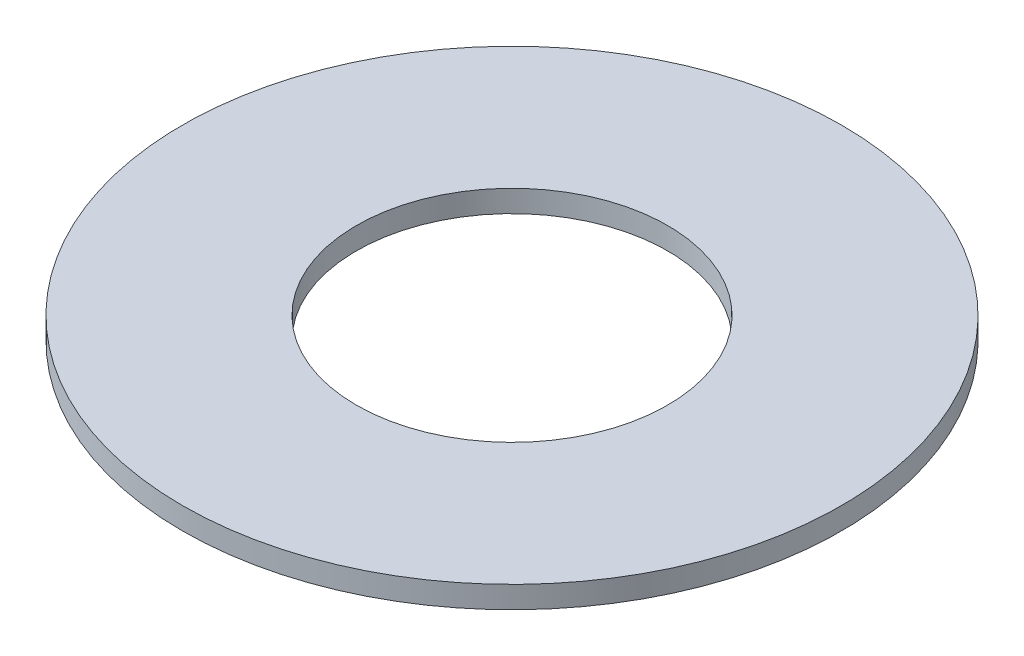
ISO-10303-21;
HEADER;
FILE_DESCRIPTION(('STEP AP214'),'2;1');
FILE_NAME('part.step','',(''),(''),'','','');
FILE_SCHEMA(('AUTOMOTIVE_DESIGN { 1 0 10303 214 1 1 1 1 }'));
ENDSEC;
DATA;
#1=APPLICATION_CONTEXT('core data for automotive mechanical design processes');
#2=APPLICATION_PROTOCOL_DEFINITION('international standard','automotive_design',2000,#1);
#3=PRODUCT_CONTEXT('',#1,'mechanical');
#4=PRODUCT('Part','Part','',(#3));
#5=PRODUCT_RELATED_PRODUCT_CATEGORY('part','',(#4));
#6=PRODUCT_DEFINITION_FORMATION('','',#4);
#7=PRODUCT_DEFINITION_CONTEXT('part definition',#1,'design');
#8=PRODUCT_DEFINITION('design','',#6,#7);
#9=PRODUCT_DEFINITION_SHAPE('','',#8);
#10=(LENGTH_UNIT() NAMED_UNIT(*) SI_UNIT(.MILLI.,.METRE.));
#11=(NAMED_UNIT(*) PLANE_ANGLE_UNIT() SI_UNIT($,.RADIAN.));
#12=(NAMED_UNIT(*) SI_UNIT($,.STERADIAN.) SOLID_ANGLE_UNIT());
#13=UNCERTAINTY_MEASURE_WITH_UNIT(LENGTH_MEASURE(1.E-05),#10,'distance_accuracy_value','');
#14=(GEOMETRIC_REPRESENTATION_CONTEXT(3) GLOBAL_UNCERTAINTY_ASSIGNED_CONTEXT((#13)) GLOBAL_UNIT_ASSIGNED_CONTEXT((#10,
#11,#12)) REPRESENTATION_CONTEXT('',''));
#15=CARTESIAN_POINT('',(0.,0.,0.));
#16=DIRECTION('',(0.,0.,1.));
#17=DIRECTION('',(1.,0.,0.));
#18=AXIS2_PLACEMENT_3D('',#15,#16,#17);
#19=CARTESIAN_POINT('',(0.,6.,0.));
#20=DIRECTION('',(0.,-1.,0.));
#21=DIRECTION('',(0.,0.,-1.));
#22=AXIS2_PLACEMENT_3D('',#19,#20,#21);
#23=CYLINDRICAL_SURFACE('',#22,90.);
#24=CARTESIAN_POINT('',(0.,6.,0.));
#25=DIRECTION('',(0.,1.,0.));
#26=DIRECTION('',(0.,0.,1.));
#27=AXIS2_PLACEMENT_3D('',#24,#25,#26);
#28=CIRCLE('',#27,90.);
#29=CARTESIAN_POINT('',(0.,6.,90.));
#30=VERTEX_POINT('',#29);
#31=EDGE_CURVE('E10',#30,#30,#28,.T.);
#32=ORIENTED_EDGE('',*,*,#31,.F.);
#33=EDGE_LOOP('',(#32));
#34=FACE_BOUND('',#33,.T.);
#35=CARTESIAN_POINT('',(0.,0.,0.));
#36=DIRECTION('',(0.,1.,0.));
#37=DIRECTION('',(0.,0.,1.));
#38=AXIS2_PLACEMENT_3D('',#35,#36,#37);
#39=CIRCLE('',#38,90.);
#40=CARTESIAN_POINT('',(0.,0.,90.));
#41=VERTEX_POINT('',#40);
#42=EDGE_CURVE('E37',#41,#41,#39,.T.);
#43=ORIENTED_EDGE('',*,*,#42,.T.);
#44=EDGE_LOOP('',(#43));
#45=FACE_BOUND('',#44,.T.);
#46=ADVANCED_FACE('F40',(#34,#45),#23,.T.);
#47=CARTESIAN_POINT('',(0.,6.,0.));
#48=DIRECTION('',(0.,1.,0.));
#49=DIRECTION('',(0.,0.,1.));
#50=AXIS2_PLACEMENT_3D('',#47,#48,#49);
#51=PLANE('',#50);
#52=CARTESIAN_POINT('',(0.,6.,0.));
#53=DIRECTION('',(0.,1.,0.));
#54=DIRECTION('',(0.,0.,1.));
#55=AXIS2_PLACEMENT_3D('',#52,#53,#54);
#56=CIRCLE('',#55,42.5);
#57=CARTESIAN_POINT('',(0.,6.,42.5));
#58=VERTEX_POINT('',#57);
#59=EDGE_CURVE('E50',#58,#58,#56,.T.);
#60=ORIENTED_EDGE('',*,*,#59,.F.);
#61=EDGE_LOOP('',(#60));
#62=FACE_BOUND('',#61,.T.);
#63=ORIENTED_EDGE('',*,*,#31,.T.);
#64=EDGE_LOOP('',(#63));
#65=FACE_BOUND('',#64,.T.);
#66=ADVANCED_FACE('F59',(#62,#65),#51,.T.);
#67=CARTESIAN_POINT('',(0.,0.,0.));
#68=DIRECTION('',(0.,1.,0.));
#69=DIRECTION('',(0.,0.,1.));
#70=AXIS2_PLACEMENT_3D('',#67,#68,#69);
#71=PLANE('',#70);
#72=CARTESIAN_POINT('',(0.,0.,0.));
#73=DIRECTION('',(0.,1.,0.));
#74=DIRECTION('',(0.,0.,1.));
#75=AXIS2_PLACEMENT_3D('',#72,#73,#74);
#76=CIRCLE('',#75,42.5);
#77=CARTESIAN_POINT('',(0.,0.,42.5));
#78=VERTEX_POINT('',#77);
#79=EDGE_CURVE('E47',#78,#78,#76,.T.);
#80=ORIENTED_EDGE('',*,*,#79,.T.);
#81=EDGE_LOOP('',(#80));
#82=FACE_BOUND('',#81,.T.);
#83=ORIENTED_EDGE('',*,*,#42,.F.);
#84=EDGE_LOOP('',(#83));
#85=FACE_BOUND('',#84,.T.);
#86=ADVANCED_FACE('F58',(#82,#85),#71,.F.);
#87=CARTESIAN_POINT('',(0.,6.,0.));
#88=DIRECTION('',(0.,-1.,0.));
#89=DIRECTION('',(0.,0.,-1.));
#90=AXIS2_PLACEMENT_3D('',#87,#88,#89);
#91=CYLINDRICAL_SURFACE('',#90,42.5);
#92=ORIENTED_EDGE('',*,*,#59,.T.);
#93=EDGE_LOOP('',(#92));
#94=FACE_BOUND('',#93,.T.);
#95=ORIENTED_EDGE('',*,*,#79,.F.);
#96=EDGE_LOOP('',(#95));
#97=FACE_BOUND('',#96,.T.);
#98=ADVANCED_FACE('F54',(#94,#97),#91,.F.);
#99=CLOSED_SHELL('',(#46,#66,#86,#98));
#100=MANIFOLD_SOLID_BREP('B2',#99);
#101=ADVANCED_BREP_SHAPE_REPRESENTATION('',(#18,#100),#14);
#102=SHAPE_DEFINITION_REPRESENTATION(#9,#101);
ENDSEC;
END-ISO-10303-21;
